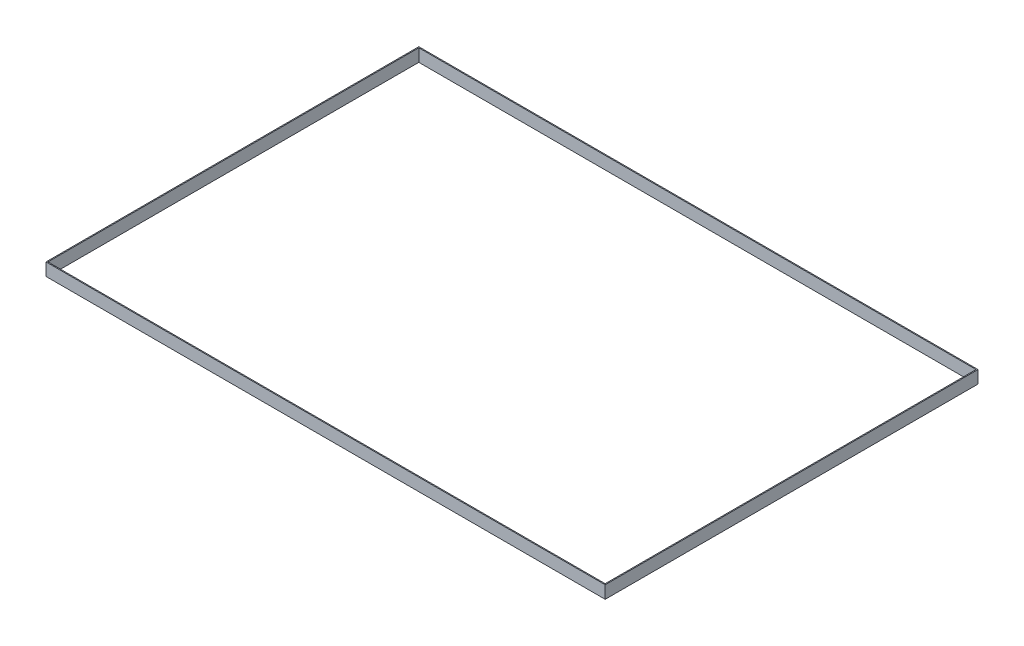
ISO-10303-21;
HEADER;
FILE_DESCRIPTION(('STEP AP214'),'2;1');
FILE_NAME('part.step','',(''),(''),'','','');
FILE_SCHEMA(('AUTOMOTIVE_DESIGN { 1 0 10303 214 1 1 1 1 }'));
ENDSEC;
DATA;
#1=APPLICATION_CONTEXT('core data for automotive mechanical design processes');
#2=APPLICATION_PROTOCOL_DEFINITION('international standard','automotive_design',2000,#1);
#3=PRODUCT_CONTEXT('',#1,'mechanical');
#4=PRODUCT('Part','Part','',(#3));
#5=PRODUCT_RELATED_PRODUCT_CATEGORY('part','',(#4));
#6=PRODUCT_DEFINITION_FORMATION('','',#4);
#7=PRODUCT_DEFINITION_CONTEXT('part definition',#1,'design');
#8=PRODUCT_DEFINITION('design','',#6,#7);
#9=PRODUCT_DEFINITION_SHAPE('','',#8);
#10=(LENGTH_UNIT() NAMED_UNIT(*) SI_UNIT(.MILLI.,.METRE.));
#11=(NAMED_UNIT(*) PLANE_ANGLE_UNIT() SI_UNIT($,.RADIAN.));
#12=(NAMED_UNIT(*) SI_UNIT($,.STERADIAN.) SOLID_ANGLE_UNIT());
#13=UNCERTAINTY_MEASURE_WITH_UNIT(LENGTH_MEASURE(1.E-05),#10,'distance_accuracy_value','');
#14=(GEOMETRIC_REPRESENTATION_CONTEXT(3) GLOBAL_UNCERTAINTY_ASSIGNED_CONTEXT((#13)) GLOBAL_UNIT_ASSIGNED_CONTEXT((#10,
#11,#12)) REPRESENTATION_CONTEXT('',''));
#15=CARTESIAN_POINT('',(0.,0.,0.));
#16=DIRECTION('',(0.,0.,1.));
#17=DIRECTION('',(1.,0.,0.));
#18=AXIS2_PLACEMENT_3D('',#15,#16,#17);
#19=CARTESIAN_POINT('',(0.,6.35,0.));
#20=DIRECTION('',(1.,0.,0.));
#21=DIRECTION('',(0.,0.,-1.));
#22=AXIS2_PLACEMENT_3D('',#19,#20,#21);
#23=PLANE('',#22);
#24=DIRECTION('',(0.,0.,1.));
#25=VECTOR('',#24,1.);
#26=CARTESIAN_POINT('',(0.,0.,0.));
#27=LINE('',#26,#25);
#28=CARTESIAN_POINT('',(0.,0.,-2438.4));
#29=VERTEX_POINT('',#28);
#30=CARTESIAN_POINT('',(0.,0.,0.));
#31=VERTEX_POINT('',#30);
#32=EDGE_CURVE('E154',#29,#31,#27,.T.);
#33=ORIENTED_EDGE('',*,*,#32,.T.);
#34=DIRECTION('',(0.,-1.,0.));
#35=VECTOR('',#34,1.);
#36=CARTESIAN_POINT('',(0.,6.35,0.));
#37=LINE('',#36,#35);
#38=CARTESIAN_POINT('',(0.,82.55,0.));
#39=VERTEX_POINT('',#38);
#40=EDGE_CURVE('E11',#39,#31,#37,.T.);
#41=ORIENTED_EDGE('',*,*,#40,.F.);
#42=DIRECTION('',(0.,0.,1.));
#43=VECTOR('',#42,1.);
#44=CARTESIAN_POINT('',(0.,82.55,-2438.4));
#45=LINE('',#44,#43);
#46=CARTESIAN_POINT('',(0.,82.55,-2438.4));
#47=VERTEX_POINT('',#46);
#48=EDGE_CURVE('E113',#47,#39,#45,.T.);
#49=ORIENTED_EDGE('',*,*,#48,.F.);
#50=DIRECTION('',(0.,-1.,0.));
#51=VECTOR('',#50,1.);
#52=CARTESIAN_POINT('',(0.,6.35,-2438.4));
#53=LINE('',#52,#51);
#54=EDGE_CURVE('E162',#47,#29,#53,.T.);
#55=ORIENTED_EDGE('',*,*,#54,.T.);
#56=EDGE_LOOP('',(#33,#41,#49,#55));
#57=FACE_BOUND('',#56,.T.);
#58=ADVANCED_FACE('F38',(#57),#23,.F.);
#59=CARTESIAN_POINT('',(0.,6.35,0.));
#60=DIRECTION('',(0.,0.,-1.));
#61=DIRECTION('',(-1.,0.,0.));
#62=AXIS2_PLACEMENT_3D('',#59,#60,#61);
#63=PLANE('',#62);
#64=DIRECTION('',(1.,0.,0.));
#65=VECTOR('',#64,1.);
#66=CARTESIAN_POINT('',(0.,0.,0.));
#67=LINE('',#66,#65);
#68=CARTESIAN_POINT('',(3657.6,0.,0.));
#69=VERTEX_POINT('',#68);
#70=EDGE_CURVE('E157',#31,#69,#67,.T.);
#71=ORIENTED_EDGE('',*,*,#70,.T.);
#72=DIRECTION('',(0.,-1.,0.));
#73=VECTOR('',#72,1.);
#74=CARTESIAN_POINT('',(3657.6,6.35,0.));
#75=LINE('',#74,#73);
#76=CARTESIAN_POINT('',(3657.6,82.55,0.));
#77=VERTEX_POINT('',#76);
#78=EDGE_CURVE('E45',#77,#69,#75,.T.);
#79=ORIENTED_EDGE('',*,*,#78,.F.);
#80=DIRECTION('',(1.,0.,0.));
#81=VECTOR('',#80,1.);
#82=CARTESIAN_POINT('',(0.,82.55,0.));
#83=LINE('',#82,#81);
#84=EDGE_CURVE('E145',#39,#77,#83,.T.);
#85=ORIENTED_EDGE('',*,*,#84,.F.);
#86=ORIENTED_EDGE('',*,*,#40,.T.);
#87=EDGE_LOOP('',(#71,#79,#85,#86));
#88=FACE_BOUND('',#87,.T.);
#89=ADVANCED_FACE('F180',(#88),#63,.F.);
#90=CARTESIAN_POINT('',(3657.6,6.35,0.));
#91=DIRECTION('',(-1.,0.,0.));
#92=DIRECTION('',(0.,0.,1.));
#93=AXIS2_PLACEMENT_3D('',#90,#91,#92);
#94=PLANE('',#93);
#95=DIRECTION('',(0.,0.,-1.));
#96=VECTOR('',#95,1.);
#97=CARTESIAN_POINT('',(3657.6,0.,0.));
#98=LINE('',#97,#96);
#99=CARTESIAN_POINT('',(3657.6,0.,-2438.4));
#100=VERTEX_POINT('',#99);
#101=EDGE_CURVE('E159',#69,#100,#98,.T.);
#102=ORIENTED_EDGE('',*,*,#101,.T.);
#103=DIRECTION('',(0.,-1.,0.));
#104=VECTOR('',#103,1.);
#105=CARTESIAN_POINT('',(3657.6,6.35,-2438.4));
#106=LINE('',#105,#104);
#107=CARTESIAN_POINT('',(3657.6,82.55,-2438.4));
#108=VERTEX_POINT('',#107);
#109=EDGE_CURVE('E164',#108,#100,#106,.T.);
#110=ORIENTED_EDGE('',*,*,#109,.F.);
#111=DIRECTION('',(0.,0.,-1.));
#112=VECTOR('',#111,1.);
#113=CARTESIAN_POINT('',(3657.6,82.55,-2438.4));
#114=LINE('',#113,#112);
#115=EDGE_CURVE('E148',#77,#108,#114,.T.);
#116=ORIENTED_EDGE('',*,*,#115,.F.);
#117=ORIENTED_EDGE('',*,*,#78,.T.);
#118=EDGE_LOOP('',(#102,#110,#116,#117));
#119=FACE_BOUND('',#118,.T.);
#120=ADVANCED_FACE('F169',(#119),#94,.F.);
#121=CARTESIAN_POINT('',(0.,6.35,-2438.4));
#122=DIRECTION('',(0.,0.,1.));
#123=DIRECTION('',(1.,0.,0.));
#124=AXIS2_PLACEMENT_3D('',#121,#122,#123);
#125=PLANE('',#124);
#126=DIRECTION('',(-1.,0.,0.));
#127=VECTOR('',#126,1.);
#128=CARTESIAN_POINT('',(0.,0.,-2438.4));
#129=LINE('',#128,#127);
#130=EDGE_CURVE('E60',#100,#29,#129,.T.);
#131=ORIENTED_EDGE('',*,*,#130,.T.);
#132=ORIENTED_EDGE('',*,*,#54,.F.);
#133=DIRECTION('',(-1.,0.,0.));
#134=VECTOR('',#133,1.);
#135=CARTESIAN_POINT('',(0.,82.55,-2438.4));
#136=LINE('',#135,#134);
#137=EDGE_CURVE('E151',#108,#47,#136,.T.);
#138=ORIENTED_EDGE('',*,*,#137,.F.);
#139=ORIENTED_EDGE('',*,*,#109,.T.);
#140=EDGE_LOOP('',(#131,#132,#138,#139));
#141=FACE_BOUND('',#140,.T.);
#142=ADVANCED_FACE('F176',(#141),#125,.F.);
#143=CARTESIAN_POINT('',(0.,0.,0.));
#144=DIRECTION('',(0.,-1.,0.));
#145=DIRECTION('',(0.,0.,-1.));
#146=AXIS2_PLACEMENT_3D('',#143,#144,#145);
#147=PLANE('',#146);
#148=DIRECTION('',(0.,0.,1.));
#149=VECTOR('',#148,1.);
#150=CARTESIAN_POINT('',(6.34999999999999,0.,-2432.05));
#151=LINE('',#150,#149);
#152=CARTESIAN_POINT('',(6.34999999999999,0.,-2432.05));
#153=VERTEX_POINT('',#152);
#154=CARTESIAN_POINT('',(6.34999999999999,0.,-6.34999999999999));
#155=VERTEX_POINT('',#154);
#156=EDGE_CURVE('E108',#153,#155,#151,.T.);
#157=ORIENTED_EDGE('',*,*,#156,.T.);
#158=DIRECTION('',(1.,0.,0.));
#159=VECTOR('',#158,1.);
#160=CARTESIAN_POINT('',(6.34999999999999,0.,-6.34999999999999));
#161=LINE('',#160,#159);
#162=CARTESIAN_POINT('',(3651.25,0.,-6.34999999999999));
#163=VERTEX_POINT('',#162);
#164=EDGE_CURVE('E116',#155,#163,#161,.T.);
#165=ORIENTED_EDGE('',*,*,#164,.T.);
#166=DIRECTION('',(0.,0.,-1.));
#167=VECTOR('',#166,1.);
#168=CARTESIAN_POINT('',(3651.25,0.,-2432.05));
#169=LINE('',#168,#167);
#170=CARTESIAN_POINT('',(3651.25,0.,-2432.05));
#171=VERTEX_POINT('',#170);
#172=EDGE_CURVE('E120',#163,#171,#169,.T.);
#173=ORIENTED_EDGE('',*,*,#172,.T.);
#174=DIRECTION('',(-1.,0.,0.));
#175=VECTOR('',#174,1.);
#176=CARTESIAN_POINT('',(6.34999999999999,0.,-2432.05));
#177=LINE('',#176,#175);
#178=EDGE_CURVE('E125',#171,#153,#177,.T.);
#179=ORIENTED_EDGE('',*,*,#178,.T.);
#180=EDGE_LOOP('',(#157,#165,#173,#179));
#181=FACE_BOUND('',#180,.T.);
#182=ORIENTED_EDGE('',*,*,#32,.F.);
#183=ORIENTED_EDGE('',*,*,#130,.F.);
#184=ORIENTED_EDGE('',*,*,#101,.F.);
#185=ORIENTED_EDGE('',*,*,#70,.F.);
#186=EDGE_LOOP('',(#182,#183,#184,#185));
#187=FACE_BOUND('',#186,.T.);
#188=ADVANCED_FACE('F122',(#181,#187),#147,.T.);
#189=CARTESIAN_POINT('',(0.,82.55,0.));
#190=DIRECTION('',(0.,1.,0.));
#191=DIRECTION('',(0.,0.,1.));
#192=AXIS2_PLACEMENT_3D('',#189,#190,#191);
#193=PLANE('',#192);
#194=ORIENTED_EDGE('',*,*,#48,.T.);
#195=ORIENTED_EDGE('',*,*,#84,.T.);
#196=ORIENTED_EDGE('',*,*,#115,.T.);
#197=ORIENTED_EDGE('',*,*,#137,.T.);
#198=EDGE_LOOP('',(#194,#195,#196,#197));
#199=FACE_BOUND('',#198,.T.);
#200=DIRECTION('',(1.,0.,0.));
#201=VECTOR('',#200,1.);
#202=CARTESIAN_POINT('',(6.35000000000028,82.55,-6.34999999999999));
#203=LINE('',#202,#201);
#204=CARTESIAN_POINT('',(6.35000000000028,82.55,-6.34999999999999));
#205=VERTEX_POINT('',#204);
#206=CARTESIAN_POINT('',(3651.25,82.55,-6.35));
#207=VERTEX_POINT('',#206);
#208=EDGE_CURVE('E131',#205,#207,#203,.T.);
#209=ORIENTED_EDGE('',*,*,#208,.F.);
#210=DIRECTION('',(0.,0.,1.));
#211=VECTOR('',#210,1.);
#212=CARTESIAN_POINT('',(6.34999999999999,82.55,-2432.05));
#213=LINE('',#212,#211);
#214=CARTESIAN_POINT('',(6.34999999999999,82.55,-2432.05));
#215=VERTEX_POINT('',#214);
#216=EDGE_CURVE('E111',#215,#205,#213,.T.);
#217=ORIENTED_EDGE('',*,*,#216,.F.);
#218=DIRECTION('',(-1.,0.,0.));
#219=VECTOR('',#218,1.);
#220=CARTESIAN_POINT('',(6.34999999999999,82.55,-2432.05));
#221=LINE('',#220,#219);
#222=CARTESIAN_POINT('',(3651.25,82.55,-2432.05));
#223=VERTEX_POINT('',#222);
#224=EDGE_CURVE('E136',#223,#215,#221,.T.);
#225=ORIENTED_EDGE('',*,*,#224,.F.);
#226=DIRECTION('',(0.,0.,-1.));
#227=VECTOR('',#226,1.);
#228=CARTESIAN_POINT('',(3651.25,82.55,-2432.05));
#229=LINE('',#228,#227);
#230=EDGE_CURVE('E133',#207,#223,#229,.T.);
#231=ORIENTED_EDGE('',*,*,#230,.F.);
#232=EDGE_LOOP('',(#209,#217,#225,#231));
#233=FACE_BOUND('',#232,.T.);
#234=ADVANCED_FACE('F178',(#199,#233),#193,.T.);
#235=CARTESIAN_POINT('',(6.34999999999999,82.55,-2432.05));
#236=DIRECTION('',(1.,0.,0.));
#237=DIRECTION('',(0.,0.,-1.));
#238=AXIS2_PLACEMENT_3D('',#235,#236,#237);
#239=PLANE('',#238);
#240=DIRECTION('',(0.,-1.,0.));
#241=VECTOR('',#240,1.);
#242=CARTESIAN_POINT('',(6.35000000000028,82.55,-6.34999999999999));
#243=LINE('',#242,#241);
#244=EDGE_CURVE('E104',#205,#155,#243,.T.);
#245=ORIENTED_EDGE('',*,*,#244,.T.);
#246=ORIENTED_EDGE('',*,*,#156,.F.);
#247=DIRECTION('',(0.,-1.,0.));
#248=VECTOR('',#247,1.);
#249=CARTESIAN_POINT('',(6.34999999999999,82.55,-2432.05));
#250=LINE('',#249,#248);
#251=EDGE_CURVE('E138',#215,#153,#250,.T.);
#252=ORIENTED_EDGE('',*,*,#251,.F.);
#253=ORIENTED_EDGE('',*,*,#216,.T.);
#254=EDGE_LOOP('',(#245,#246,#252,#253));
#255=FACE_BOUND('',#254,.T.);
#256=ADVANCED_FACE('F105',(#255),#239,.T.);
#257=CARTESIAN_POINT('',(6.35000000000028,82.55,-6.34999999999999));
#258=DIRECTION('',(0.,0.,-1.));
#259=DIRECTION('',(-1.,0.,0.));
#260=AXIS2_PLACEMENT_3D('',#257,#258,#259);
#261=PLANE('',#260);
#262=DIRECTION('',(0.,-1.,0.));
#263=VECTOR('',#262,1.);
#264=CARTESIAN_POINT('',(3651.25,82.55,-6.35));
#265=LINE('',#264,#263);
#266=EDGE_CURVE('E52',#207,#163,#265,.T.);
#267=ORIENTED_EDGE('',*,*,#266,.T.);
#268=ORIENTED_EDGE('',*,*,#164,.F.);
#269=ORIENTED_EDGE('',*,*,#244,.F.);
#270=ORIENTED_EDGE('',*,*,#208,.T.);
#271=EDGE_LOOP('',(#267,#268,#269,#270));
#272=FACE_BOUND('',#271,.T.);
#273=ADVANCED_FACE('F117',(#272),#261,.T.);
#274=CARTESIAN_POINT('',(3651.25,82.55,-2432.05));
#275=DIRECTION('',(-1.,0.,0.));
#276=DIRECTION('',(0.,0.,1.));
#277=AXIS2_PLACEMENT_3D('',#274,#275,#276);
#278=PLANE('',#277);
#279=DIRECTION('',(0.,-1.,0.));
#280=VECTOR('',#279,1.);
#281=CARTESIAN_POINT('',(3651.25,82.55,-2432.05));
#282=LINE('',#281,#280);
#283=EDGE_CURVE('E140',#223,#171,#282,.T.);
#284=ORIENTED_EDGE('',*,*,#283,.T.);
#285=ORIENTED_EDGE('',*,*,#172,.F.);
#286=ORIENTED_EDGE('',*,*,#266,.F.);
#287=ORIENTED_EDGE('',*,*,#230,.T.);
#288=EDGE_LOOP('',(#284,#285,#286,#287));
#289=FACE_BOUND('',#288,.T.);
#290=ADVANCED_FACE('F198',(#289),#278,.T.);
#291=CARTESIAN_POINT('',(6.34999999999999,82.55,-2432.05));
#292=DIRECTION('',(0.,0.,1.));
#293=DIRECTION('',(1.,0.,0.));
#294=AXIS2_PLACEMENT_3D('',#291,#292,#293);
#295=PLANE('',#294);
#296=ORIENTED_EDGE('',*,*,#251,.T.);
#297=ORIENTED_EDGE('',*,*,#178,.F.);
#298=ORIENTED_EDGE('',*,*,#283,.F.);
#299=ORIENTED_EDGE('',*,*,#224,.T.);
#300=EDGE_LOOP('',(#296,#297,#298,#299));
#301=FACE_BOUND('',#300,.T.);
#302=ADVANCED_FACE('F201',(#301),#295,.T.);
#303=CLOSED_SHELL('',(#58,#89,#120,#142,#188,#234,#256,#273,#290,#302));
#304=MANIFOLD_SOLID_BREP('B2',#303);
#305=ADVANCED_BREP_SHAPE_REPRESENTATION('',(#18,#304),#14);
#306=SHAPE_DEFINITION_REPRESENTATION(#9,#305);
ENDSEC;
END-ISO-10303-21;
